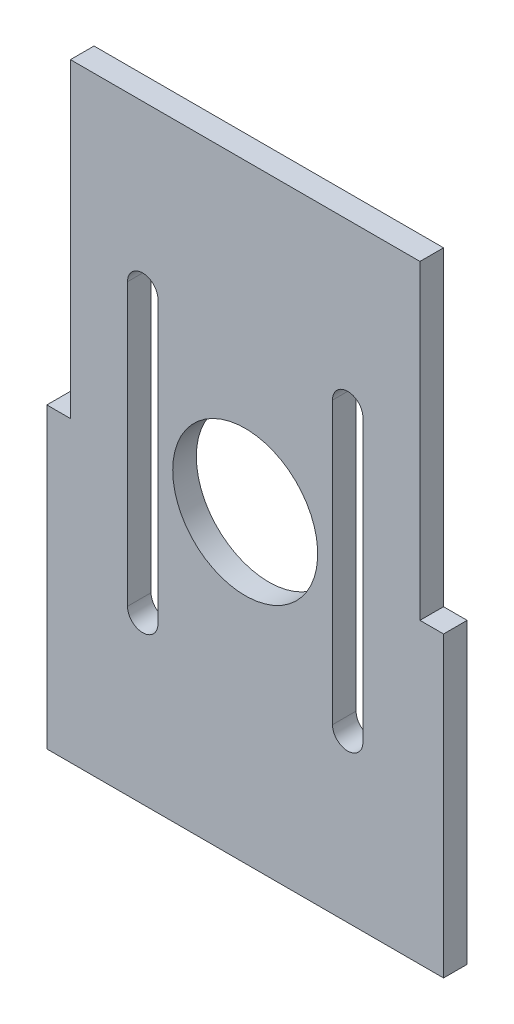
ISO-10303-21;
HEADER;
FILE_DESCRIPTION(('STEP AP214'),'2;1');
FILE_NAME('part.step','',(''),(''),'','','');
FILE_SCHEMA(('AUTOMOTIVE_DESIGN { 1 0 10303 214 1 1 1 1 }'));
ENDSEC;
DATA;
#1=APPLICATION_CONTEXT('core data for automotive mechanical design processes');
#2=APPLICATION_PROTOCOL_DEFINITION('international standard','automotive_design',2000,#1);
#3=PRODUCT_CONTEXT('',#1,'mechanical');
#4=PRODUCT('Part','Part','',(#3));
#5=PRODUCT_RELATED_PRODUCT_CATEGORY('part','',(#4));
#6=PRODUCT_DEFINITION_FORMATION('','',#4);
#7=PRODUCT_DEFINITION_CONTEXT('part definition',#1,'design');
#8=PRODUCT_DEFINITION('design','',#6,#7);
#9=PRODUCT_DEFINITION_SHAPE('','',#8);
#10=(LENGTH_UNIT() NAMED_UNIT(*) SI_UNIT(.MILLI.,.METRE.));
#11=(NAMED_UNIT(*) PLANE_ANGLE_UNIT() SI_UNIT($,.RADIAN.));
#12=(NAMED_UNIT(*) SI_UNIT($,.STERADIAN.) SOLID_ANGLE_UNIT());
#13=UNCERTAINTY_MEASURE_WITH_UNIT(LENGTH_MEASURE(1.E-05),#10,'distance_accuracy_value','');
#14=(GEOMETRIC_REPRESENTATION_CONTEXT(3) GLOBAL_UNCERTAINTY_ASSIGNED_CONTEXT((#13)) GLOBAL_UNIT_ASSIGNED_CONTEXT((#10,
#11,#12)) REPRESENTATION_CONTEXT('',''));
#15=CARTESIAN_POINT('',(0.,0.,0.));
#16=DIRECTION('',(0.,0.,1.));
#17=DIRECTION('',(1.,0.,0.));
#18=AXIS2_PLACEMENT_3D('',#15,#16,#17);
#19=CARTESIAN_POINT('',(0.,0.,3.1));
#20=DIRECTION('',(0.,0.,-1.));
#21=DIRECTION('',(-1.,0.,0.));
#22=AXIS2_PLACEMENT_3D('',#19,#20,#21);
#23=PLANE('',#22);
#24=CARTESIAN_POINT('',(-13.4703841816037,18.4703841816037,3.1));
#25=DIRECTION('',(0.,0.,-1.));
#26=DIRECTION('',(-1.,0.,0.));
#27=AXIS2_PLACEMENT_3D('',#24,#25,#26);
#28=CIRCLE('',#27,1.99999999999998);
#29=CARTESIAN_POINT('',(-11.4703841816037,18.4703841816037,3.1));
#30=VERTEX_POINT('',#29);
#31=CARTESIAN_POINT('',(-15.4703841816037,18.4703841816037,3.1));
#32=VERTEX_POINT('',#31);
#33=EDGE_CURVE('E211',#30,#32,#28,.F.);
#34=ORIENTED_EDGE('',*,*,#33,.F.);
#35=DIRECTION('',(0.,1.,0.));
#36=VECTOR('',#35,1.);
#37=CARTESIAN_POINT('',(-11.4703841816037,0.,3.1));
#38=LINE('',#37,#36);
#39=CARTESIAN_POINT('',(-11.4703841816038,-18.4703841816038,3.1));
#40=VERTEX_POINT('',#39);
#41=EDGE_CURVE('E204',#40,#30,#38,.T.);
#42=ORIENTED_EDGE('',*,*,#41,.F.);
#43=CARTESIAN_POINT('',(-13.4703841816037,-18.4703841816038,3.1));
#44=DIRECTION('',(0.,0.,-1.));
#45=DIRECTION('',(-1.,0.,0.));
#46=AXIS2_PLACEMENT_3D('',#43,#44,#45);
#47=CIRCLE('',#46,1.99999999999998);
#48=CARTESIAN_POINT('',(-15.4703841816037,-18.4703841816038,3.1));
#49=VERTEX_POINT('',#48);
#50=EDGE_CURVE('E206',#49,#40,#47,.F.);
#51=ORIENTED_EDGE('',*,*,#50,.F.);
#52=DIRECTION('',(0.,-1.,0.));
#53=VECTOR('',#52,1.);
#54=CARTESIAN_POINT('',(-15.4703841816037,0.,3.1));
#55=LINE('',#54,#53);
#56=EDGE_CURVE('E209',#32,#49,#55,.T.);
#57=ORIENTED_EDGE('',*,*,#56,.F.);
#58=EDGE_LOOP('',(#34,#42,#51,#57));
#59=FACE_BOUND('',#58,.T.);
#60=DIRECTION('',(1.,0.,0.));
#61=VECTOR('',#60,1.);
#62=CARTESIAN_POINT('',(-22.965,-40.,3.1));
#63=LINE('',#62,#61);
#64=CARTESIAN_POINT('',(-26.065,-40.,3.1));
#65=VERTEX_POINT('',#64);
#66=CARTESIAN_POINT('',(26.065,-40.,3.1));
#67=VERTEX_POINT('',#66);
#68=EDGE_CURVE('E295',#65,#67,#63,.T.);
#69=ORIENTED_EDGE('',*,*,#68,.T.);
#70=DIRECTION('',(0.,1.,0.));
#71=VECTOR('',#70,1.);
#72=CARTESIAN_POINT('',(26.065,-0.846178762556278,3.1));
#73=LINE('',#72,#71);
#74=CARTESIAN_POINT('',(26.065,-0.846178762556278,3.1));
#75=VERTEX_POINT('',#74);
#76=EDGE_CURVE('E261',#67,#75,#73,.T.);
#77=ORIENTED_EDGE('',*,*,#76,.T.);
#78=DIRECTION('',(-1.,0.,0.));
#79=VECTOR('',#78,1.);
#80=CARTESIAN_POINT('',(22.965,-0.846178762556279,3.1));
#81=LINE('',#80,#79);
#82=CARTESIAN_POINT('',(22.965,-0.846178762556279,3.1));
#83=VERTEX_POINT('',#82);
#84=EDGE_CURVE('E264',#75,#83,#81,.T.);
#85=ORIENTED_EDGE('',*,*,#84,.T.);
#86=DIRECTION('',(0.,1.,0.));
#87=VECTOR('',#86,1.);
#88=CARTESIAN_POINT('',(22.965,-40.,3.1));
#89=LINE('',#88,#87);
#90=CARTESIAN_POINT('',(22.965,40.,3.1));
#91=VERTEX_POINT('',#90);
#92=EDGE_CURVE('E293',#83,#91,#89,.T.);
#93=ORIENTED_EDGE('',*,*,#92,.T.);
#94=DIRECTION('',(-1.,0.,0.));
#95=VECTOR('',#94,1.);
#96=CARTESIAN_POINT('',(-22.965,40.,3.1));
#97=LINE('',#96,#95);
#98=CARTESIAN_POINT('',(-22.965,40.,3.1));
#99=VERTEX_POINT('',#98);
#100=EDGE_CURVE('E301',#91,#99,#97,.T.);
#101=ORIENTED_EDGE('',*,*,#100,.T.);
#102=DIRECTION('',(0.,-1.,0.));
#103=VECTOR('',#102,1.);
#104=CARTESIAN_POINT('',(-22.965,-40.,3.1));
#105=LINE('',#104,#103);
#106=CARTESIAN_POINT('',(-22.965,-0.846178762556285,3.1));
#107=VERTEX_POINT('',#106);
#108=EDGE_CURVE('E236',#99,#107,#105,.T.);
#109=ORIENTED_EDGE('',*,*,#108,.T.);
#110=DIRECTION('',(-1.,0.,0.));
#111=VECTOR('',#110,1.);
#112=CARTESIAN_POINT('',(-22.965,-0.846178762556284,3.1));
#113=LINE('',#112,#111);
#114=CARTESIAN_POINT('',(-26.065,-0.846178762556284,3.1));
#115=VERTEX_POINT('',#114);
#116=EDGE_CURVE('E224',#107,#115,#113,.T.);
#117=ORIENTED_EDGE('',*,*,#116,.T.);
#118=DIRECTION('',(0.,-1.,0.));
#119=VECTOR('',#118,1.);
#120=CARTESIAN_POINT('',(-26.065,-0.846178762556284,3.1));
#121=LINE('',#120,#119);
#122=EDGE_CURVE('E220',#115,#65,#121,.T.);
#123=ORIENTED_EDGE('',*,*,#122,.T.);
#124=EDGE_LOOP('',(#69,#77,#85,#93,#101,#109,#117,#123));
#125=FACE_BOUND('',#124,.T.);
#126=CARTESIAN_POINT('',(0.,0.,3.1));
#127=DIRECTION('',(0.,0.,-1.));
#128=DIRECTION('',(-1.,0.,0.));
#129=AXIS2_PLACEMENT_3D('',#126,#127,#128);
#130=CIRCLE('',#129,9.525);
#131=CARTESIAN_POINT('',(-9.525,0.,3.1));
#132=VERTEX_POINT('',#131);
#133=EDGE_CURVE('E216',#132,#132,#130,.F.);
#134=ORIENTED_EDGE('',*,*,#133,.F.);
#135=EDGE_LOOP('',(#134));
#136=FACE_BOUND('',#135,.T.);
#137=CARTESIAN_POINT('',(13.4703841816037,-18.4703841816038,3.1));
#138=DIRECTION('',(0.,0.,-1.));
#139=DIRECTION('',(-1.,0.,0.));
#140=AXIS2_PLACEMENT_3D('',#137,#138,#139);
#141=CIRCLE('',#140,1.99999999999998);
#142=CARTESIAN_POINT('',(11.4703841816037,-18.4703841816038,3.1));
#143=VERTEX_POINT('',#142);
#144=CARTESIAN_POINT('',(15.4703841816037,-18.4703841816038,3.1));
#145=VERTEX_POINT('',#144);
#146=EDGE_CURVE('E151',#143,#145,#141,.F.);
#147=ORIENTED_EDGE('',*,*,#146,.F.);
#148=DIRECTION('',(0.,-1.,0.));
#149=VECTOR('',#148,1.);
#150=CARTESIAN_POINT('',(11.4703841816037,0.,3.1));
#151=LINE('',#150,#149);
#152=CARTESIAN_POINT('',(11.4703841816037,18.4703841816037,3.1));
#153=VERTEX_POINT('',#152);
#154=EDGE_CURVE('E176',#153,#143,#151,.T.);
#155=ORIENTED_EDGE('',*,*,#154,.F.);
#156=CARTESIAN_POINT('',(13.4703841816037,18.4703841816037,3.1));
#157=DIRECTION('',(0.,0.,-1.));
#158=DIRECTION('',(-1.,0.,0.));
#159=AXIS2_PLACEMENT_3D('',#156,#157,#158);
#160=CIRCLE('',#159,1.99999999999998);
#161=CARTESIAN_POINT('',(15.4703841816037,18.4703841816037,3.1));
#162=VERTEX_POINT('',#161);
#163=EDGE_CURVE('E178',#162,#153,#160,.F.);
#164=ORIENTED_EDGE('',*,*,#163,.F.);
#165=DIRECTION('',(0.,1.,0.));
#166=VECTOR('',#165,1.);
#167=CARTESIAN_POINT('',(15.4703841816037,0.,3.1));
#168=LINE('',#167,#166);
#169=EDGE_CURVE('E180',#145,#162,#168,.T.);
#170=ORIENTED_EDGE('',*,*,#169,.F.);
#171=EDGE_LOOP('',(#147,#155,#164,#170));
#172=FACE_BOUND('',#171,.T.);
#173=ADVANCED_FACE('F33',(#59,#125,#136,#172),#23,.F.);
#174=CARTESIAN_POINT('',(0.,0.,0.));
#175=DIRECTION('',(0.,0.,-1.));
#176=DIRECTION('',(-1.,0.,0.));
#177=AXIS2_PLACEMENT_3D('',#174,#175,#176);
#178=PLANE('',#177);
#179=DIRECTION('',(0.,1.,0.));
#180=VECTOR('',#179,1.);
#181=CARTESIAN_POINT('',(-11.4703841816037,-13.4703841816038,0.));
#182=LINE('',#181,#180);
#183=CARTESIAN_POINT('',(-11.4703841816038,-18.4703841816038,0.));
#184=VERTEX_POINT('',#183);
#185=CARTESIAN_POINT('',(-11.4703841816037,18.4703841816037,0.));
#186=VERTEX_POINT('',#185);
#187=EDGE_CURVE('E192',#184,#186,#182,.T.);
#188=ORIENTED_EDGE('',*,*,#187,.T.);
#189=CARTESIAN_POINT('',(-13.4703841816037,18.4703841816037,0.));
#190=DIRECTION('',(0.,0.,1.));
#191=DIRECTION('',(1.,0.,0.));
#192=AXIS2_PLACEMENT_3D('',#189,#190,#191);
#193=CIRCLE('',#192,1.99999999999998);
#194=CARTESIAN_POINT('',(-15.4703841816037,18.4703841816037,0.));
#195=VERTEX_POINT('',#194);
#196=EDGE_CURVE('E183',#186,#195,#193,.T.);
#197=ORIENTED_EDGE('',*,*,#196,.T.);
#198=DIRECTION('',(0.,-1.,0.));
#199=VECTOR('',#198,1.);
#200=CARTESIAN_POINT('',(-15.4703841816037,-13.4703841816038,0.));
#201=LINE('',#200,#199);
#202=CARTESIAN_POINT('',(-15.4703841816037,-18.4703841816038,0.));
#203=VERTEX_POINT('',#202);
#204=EDGE_CURVE('E186',#195,#203,#201,.T.);
#205=ORIENTED_EDGE('',*,*,#204,.T.);
#206=CARTESIAN_POINT('',(-13.4703841816037,-18.4703841816038,0.));
#207=DIRECTION('',(0.,0.,1.));
#208=DIRECTION('',(1.,0.,0.));
#209=AXIS2_PLACEMENT_3D('',#206,#207,#208);
#210=CIRCLE('',#209,1.99999999999998);
#211=EDGE_CURVE('E189',#203,#184,#210,.T.);
#212=ORIENTED_EDGE('',*,*,#211,.T.);
#213=EDGE_LOOP('',(#188,#197,#205,#212));
#214=FACE_BOUND('',#213,.T.);
#215=DIRECTION('',(0.,1.,0.));
#216=VECTOR('',#215,1.);
#217=CARTESIAN_POINT('',(22.965,-40.,0.));
#218=LINE('',#217,#216);
#219=CARTESIAN_POINT('',(22.965,-0.846178762556278,0.));
#220=VERTEX_POINT('',#219);
#221=CARTESIAN_POINT('',(22.965,40.,0.));
#222=VERTEX_POINT('',#221);
#223=EDGE_CURVE('E280',#220,#222,#218,.T.);
#224=ORIENTED_EDGE('',*,*,#223,.F.);
#225=DIRECTION('',(-1.,0.,0.));
#226=VECTOR('',#225,1.);
#227=CARTESIAN_POINT('',(22.965,-0.846178762556279,0.));
#228=LINE('',#227,#226);
#229=CARTESIAN_POINT('',(26.065,-0.846178762556278,0.));
#230=VERTEX_POINT('',#229);
#231=EDGE_CURVE('E256',#230,#220,#228,.T.);
#232=ORIENTED_EDGE('',*,*,#231,.F.);
#233=DIRECTION('',(0.,1.,0.));
#234=VECTOR('',#233,1.);
#235=CARTESIAN_POINT('',(26.065,-0.846178762556278,0.));
#236=LINE('',#235,#234);
#237=CARTESIAN_POINT('',(26.065,-40.,0.));
#238=VERTEX_POINT('',#237);
#239=EDGE_CURVE('E257',#238,#230,#236,.T.);
#240=ORIENTED_EDGE('',*,*,#239,.F.);
#241=DIRECTION('',(1.,0.,0.));
#242=VECTOR('',#241,1.);
#243=CARTESIAN_POINT('',(-22.965,-40.,0.));
#244=LINE('',#243,#242);
#245=CARTESIAN_POINT('',(-26.065,-40.,0.));
#246=VERTEX_POINT('',#245);
#247=EDGE_CURVE('E286',#246,#238,#244,.T.);
#248=ORIENTED_EDGE('',*,*,#247,.F.);
#249=DIRECTION('',(0.,-1.,0.));
#250=VECTOR('',#249,1.);
#251=CARTESIAN_POINT('',(-26.065,-0.846178762556284,0.));
#252=LINE('',#251,#250);
#253=CARTESIAN_POINT('',(-26.065,-0.846178762556284,0.));
#254=VERTEX_POINT('',#253);
#255=EDGE_CURVE('E225',#254,#246,#252,.T.);
#256=ORIENTED_EDGE('',*,*,#255,.F.);
#257=DIRECTION('',(-1.,0.,0.));
#258=VECTOR('',#257,1.);
#259=CARTESIAN_POINT('',(-22.965,-0.846178762556284,0.));
#260=LINE('',#259,#258);
#261=CARTESIAN_POINT('',(-22.965,-0.846178762556284,0.));
#262=VERTEX_POINT('',#261);
#263=EDGE_CURVE('E219',#262,#254,#260,.T.);
#264=ORIENTED_EDGE('',*,*,#263,.F.);
#265=DIRECTION('',(0.,-1.,0.));
#266=VECTOR('',#265,1.);
#267=CARTESIAN_POINT('',(-22.965,-40.,0.));
#268=LINE('',#267,#266);
#269=CARTESIAN_POINT('',(-22.965,40.,0.));
#270=VERTEX_POINT('',#269);
#271=EDGE_CURVE('E284',#270,#262,#268,.T.);
#272=ORIENTED_EDGE('',*,*,#271,.F.);
#273=DIRECTION('',(-1.,0.,0.));
#274=VECTOR('',#273,1.);
#275=CARTESIAN_POINT('',(-22.965,40.,0.));
#276=LINE('',#275,#274);
#277=EDGE_CURVE('E287',#222,#270,#276,.T.);
#278=ORIENTED_EDGE('',*,*,#277,.F.);
#279=EDGE_LOOP('',(#224,#232,#240,#248,#256,#264,#272,#278));
#280=FACE_BOUND('',#279,.T.);
#281=CARTESIAN_POINT('',(0.,0.,0.));
#282=DIRECTION('',(0.,0.,1.));
#283=DIRECTION('',(1.,0.,0.));
#284=AXIS2_PLACEMENT_3D('',#281,#282,#283);
#285=CIRCLE('',#284,9.525);
#286=CARTESIAN_POINT('',(9.525,0.,0.));
#287=VERTEX_POINT('',#286);
#288=EDGE_CURVE('E213',#287,#287,#285,.T.);
#289=ORIENTED_EDGE('',*,*,#288,.T.);
#290=EDGE_LOOP('',(#289));
#291=FACE_BOUND('',#290,.T.);
#292=DIRECTION('',(0.,-1.,0.));
#293=VECTOR('',#292,1.);
#294=CARTESIAN_POINT('',(11.4703841816037,13.4703841816037,0.));
#295=LINE('',#294,#293);
#296=CARTESIAN_POINT('',(11.4703841816037,18.4703841816037,0.));
#297=VERTEX_POINT('',#296);
#298=CARTESIAN_POINT('',(11.4703841816037,-18.4703841816038,0.));
#299=VERTEX_POINT('',#298);
#300=EDGE_CURVE('E168',#297,#299,#295,.T.);
#301=ORIENTED_EDGE('',*,*,#300,.T.);
#302=CARTESIAN_POINT('',(13.4703841816037,-18.4703841816038,0.));
#303=DIRECTION('',(0.,0.,1.));
#304=DIRECTION('',(-1.,0.,0.));
#305=AXIS2_PLACEMENT_3D('',#302,#303,#304);
#306=CIRCLE('',#305,1.99999999999998);
#307=CARTESIAN_POINT('',(15.4703841816037,-18.4703841816038,0.));
#308=VERTEX_POINT('',#307);
#309=EDGE_CURVE('E58',#299,#308,#306,.T.);
#310=ORIENTED_EDGE('',*,*,#309,.T.);
#311=DIRECTION('',(0.,1.,0.));
#312=VECTOR('',#311,1.);
#313=CARTESIAN_POINT('',(15.4703841816037,13.4703841816037,0.));
#314=LINE('',#313,#312);
#315=CARTESIAN_POINT('',(15.4703841816037,18.4703841816037,0.));
#316=VERTEX_POINT('',#315);
#317=EDGE_CURVE('E158',#308,#316,#314,.T.);
#318=ORIENTED_EDGE('',*,*,#317,.T.);
#319=CARTESIAN_POINT('',(13.4703841816037,18.4703841816037,0.));
#320=DIRECTION('',(0.,0.,1.));
#321=DIRECTION('',(-1.,0.,0.));
#322=AXIS2_PLACEMENT_3D('',#319,#320,#321);
#323=CIRCLE('',#322,1.99999999999998);
#324=EDGE_CURVE('E164',#316,#297,#323,.T.);
#325=ORIENTED_EDGE('',*,*,#324,.T.);
#326=EDGE_LOOP('',(#301,#310,#318,#325));
#327=FACE_BOUND('',#326,.T.);
#328=ADVANCED_FACE('F167',(#214,#280,#291,#327),#178,.T.);
#329=CARTESIAN_POINT('',(-22.965,-40.,3.1));
#330=DIRECTION('',(1.,0.,0.));
#331=DIRECTION('',(0.,0.,-1.));
#332=AXIS2_PLACEMENT_3D('',#329,#330,#331);
#333=PLANE('',#332);
#334=DIRECTION('',(0.,0.,-1.));
#335=VECTOR('',#334,1.);
#336=CARTESIAN_POINT('',(-22.965,-0.846178762556284,3.1));
#337=LINE('',#336,#335);
#338=EDGE_CURVE('E223',#107,#262,#337,.T.);
#339=ORIENTED_EDGE('',*,*,#338,.F.);
#340=ORIENTED_EDGE('',*,*,#108,.F.);
#341=DIRECTION('',(0.,0.,-1.));
#342=VECTOR('',#341,1.);
#343=CARTESIAN_POINT('',(-22.965,40.,3.1));
#344=LINE('',#343,#342);
#345=EDGE_CURVE('E42',#99,#270,#344,.T.);
#346=ORIENTED_EDGE('',*,*,#345,.T.);
#347=ORIENTED_EDGE('',*,*,#271,.T.);
#348=EDGE_LOOP('',(#339,#340,#346,#347));
#349=FACE_BOUND('',#348,.T.);
#350=ADVANCED_FACE('F318',(#349),#333,.F.);
#351=CARTESIAN_POINT('',(22.965,-40.,3.1));
#352=DIRECTION('',(-1.,0.,0.));
#353=DIRECTION('',(0.,0.,1.));
#354=AXIS2_PLACEMENT_3D('',#351,#352,#353);
#355=PLANE('',#354);
#356=ORIENTED_EDGE('',*,*,#92,.F.);
#357=DIRECTION('',(0.,0.,-1.));
#358=VECTOR('',#357,1.);
#359=CARTESIAN_POINT('',(22.965,-0.846178762556279,3.1));
#360=LINE('',#359,#358);
#361=EDGE_CURVE('E271',#83,#220,#360,.T.);
#362=ORIENTED_EDGE('',*,*,#361,.T.);
#363=ORIENTED_EDGE('',*,*,#223,.T.);
#364=DIRECTION('',(0.,0.,-1.));
#365=VECTOR('',#364,1.);
#366=CARTESIAN_POINT('',(22.965,40.,3.1));
#367=LINE('',#366,#365);
#368=EDGE_CURVE('E11',#91,#222,#367,.T.);
#369=ORIENTED_EDGE('',*,*,#368,.F.);
#370=EDGE_LOOP('',(#356,#362,#363,#369));
#371=FACE_BOUND('',#370,.T.);
#372=ADVANCED_FACE('F35',(#371),#355,.F.);
#373=CARTESIAN_POINT('',(-22.965,40.,3.1));
#374=DIRECTION('',(0.,-1.,0.));
#375=DIRECTION('',(0.,0.,-1.));
#376=AXIS2_PLACEMENT_3D('',#373,#374,#375);
#377=PLANE('',#376);
#378=ORIENTED_EDGE('',*,*,#277,.T.);
#379=ORIENTED_EDGE('',*,*,#345,.F.);
#380=ORIENTED_EDGE('',*,*,#100,.F.);
#381=ORIENTED_EDGE('',*,*,#368,.T.);
#382=EDGE_LOOP('',(#378,#379,#380,#381));
#383=FACE_BOUND('',#382,.T.);
#384=ADVANCED_FACE('F310',(#383),#377,.F.);
#385=CARTESIAN_POINT('',(-22.965,-40.,3.1));
#386=DIRECTION('',(0.,1.,0.));
#387=DIRECTION('',(0.,0.,1.));
#388=AXIS2_PLACEMENT_3D('',#385,#386,#387);
#389=PLANE('',#388);
#390=ORIENTED_EDGE('',*,*,#247,.T.);
#391=DIRECTION('',(0.,0.,-1.));
#392=VECTOR('',#391,1.);
#393=CARTESIAN_POINT('',(26.065,-40.,3.1));
#394=LINE('',#393,#392);
#395=EDGE_CURVE('E268',#67,#238,#394,.T.);
#396=ORIENTED_EDGE('',*,*,#395,.F.);
#397=ORIENTED_EDGE('',*,*,#68,.F.);
#398=DIRECTION('',(0.,0.,-1.));
#399=VECTOR('',#398,1.);
#400=CARTESIAN_POINT('',(-26.065,-40.,3.1));
#401=LINE('',#400,#399);
#402=EDGE_CURVE('E230',#65,#246,#401,.T.);
#403=ORIENTED_EDGE('',*,*,#402,.T.);
#404=EDGE_LOOP('',(#390,#396,#397,#403));
#405=FACE_BOUND('',#404,.T.);
#406=ADVANCED_FACE('F322',(#405),#389,.F.);
#407=CARTESIAN_POINT('',(22.965,-0.846178762556279,3.1));
#408=DIRECTION('',(0.,-1.,0.));
#409=DIRECTION('',(1.,0.,0.));
#410=AXIS2_PLACEMENT_3D('',#407,#408,#409);
#411=PLANE('',#410);
#412=ORIENTED_EDGE('',*,*,#231,.T.);
#413=ORIENTED_EDGE('',*,*,#361,.F.);
#414=ORIENTED_EDGE('',*,*,#84,.F.);
#415=DIRECTION('',(0.,0.,-1.));
#416=VECTOR('',#415,1.);
#417=CARTESIAN_POINT('',(26.065,-0.846178762556278,3.1));
#418=LINE('',#417,#416);
#419=EDGE_CURVE('E263',#75,#230,#418,.T.);
#420=ORIENTED_EDGE('',*,*,#419,.T.);
#421=EDGE_LOOP('',(#412,#413,#414,#420));
#422=FACE_BOUND('',#421,.T.);
#423=ADVANCED_FACE('F329',(#422),#411,.F.);
#424=CARTESIAN_POINT('',(26.065,-0.846178762556278,3.1));
#425=DIRECTION('',(-1.,0.,0.));
#426=DIRECTION('',(0.,-1.,0.));
#427=AXIS2_PLACEMENT_3D('',#424,#425,#426);
#428=PLANE('',#427);
#429=ORIENTED_EDGE('',*,*,#239,.T.);
#430=ORIENTED_EDGE('',*,*,#419,.F.);
#431=ORIENTED_EDGE('',*,*,#76,.F.);
#432=ORIENTED_EDGE('',*,*,#395,.T.);
#433=EDGE_LOOP('',(#429,#430,#431,#432));
#434=FACE_BOUND('',#433,.T.);
#435=ADVANCED_FACE('F327',(#434),#428,.F.);
#436=CARTESIAN_POINT('',(-22.965,-0.846178762556284,3.1));
#437=DIRECTION('',(0.,-1.,0.));
#438=DIRECTION('',(1.,0.,0.));
#439=AXIS2_PLACEMENT_3D('',#436,#437,#438);
#440=PLANE('',#439);
#441=ORIENTED_EDGE('',*,*,#263,.T.);
#442=DIRECTION('',(0.,0.,-1.));
#443=VECTOR('',#442,1.);
#444=CARTESIAN_POINT('',(-26.065,-0.846178762556284,3.1));
#445=LINE('',#444,#443);
#446=EDGE_CURVE('E252',#115,#254,#445,.T.);
#447=ORIENTED_EDGE('',*,*,#446,.F.);
#448=ORIENTED_EDGE('',*,*,#116,.F.);
#449=ORIENTED_EDGE('',*,*,#338,.T.);
#450=EDGE_LOOP('',(#441,#447,#448,#449));
#451=FACE_BOUND('',#450,.T.);
#452=ADVANCED_FACE('F253',(#451),#440,.F.);
#453=CARTESIAN_POINT('',(-26.065,-0.846178762556284,3.1));
#454=DIRECTION('',(1.,0.,0.));
#455=DIRECTION('',(0.,1.,0.));
#456=AXIS2_PLACEMENT_3D('',#453,#454,#455);
#457=PLANE('',#456);
#458=ORIENTED_EDGE('',*,*,#255,.T.);
#459=ORIENTED_EDGE('',*,*,#402,.F.);
#460=ORIENTED_EDGE('',*,*,#122,.F.);
#461=ORIENTED_EDGE('',*,*,#446,.T.);
#462=EDGE_LOOP('',(#458,#459,#460,#461));
#463=FACE_BOUND('',#462,.T.);
#464=ADVANCED_FACE('F320',(#463),#457,.F.);
#465=CARTESIAN_POINT('',(0.,0.,3.10005));
#466=DIRECTION('',(0.,0.,-1.));
#467=DIRECTION('',(-1.,0.,0.));
#468=AXIS2_PLACEMENT_3D('',#465,#466,#467);
#469=CYLINDRICAL_SURFACE('',#468,9.525);
#470=ORIENTED_EDGE('',*,*,#288,.F.);
#471=EDGE_LOOP('',(#470));
#472=FACE_BOUND('',#471,.T.);
#473=ORIENTED_EDGE('',*,*,#133,.T.);
#474=EDGE_LOOP('',(#473));
#475=FACE_BOUND('',#474,.T.);
#476=ADVANCED_FACE('F374',(#472,#475),#469,.F.);
#477=CARTESIAN_POINT('',(-13.4703841816037,18.4703841816037,3.10005));
#478=DIRECTION('',(0.,0.,-1.));
#479=DIRECTION('',(-1.,0.,0.));
#480=AXIS2_PLACEMENT_3D('',#477,#478,#479);
#481=CYLINDRICAL_SURFACE('',#480,1.99999999999998);
#482=ORIENTED_EDGE('',*,*,#33,.T.);
#483=DIRECTION('',(0.,0.,-1.));
#484=VECTOR('',#483,1.);
#485=CARTESIAN_POINT('',(-15.4703841816037,18.4703841816037,3.10005));
#486=LINE('',#485,#484);
#487=EDGE_CURVE('E199',#32,#195,#486,.T.);
#488=ORIENTED_EDGE('',*,*,#487,.T.);
#489=ORIENTED_EDGE('',*,*,#196,.F.);
#490=DIRECTION('',(0.,0.,-1.));
#491=VECTOR('',#490,1.);
#492=CARTESIAN_POINT('',(-11.4703841816037,18.4703841816037,3.10005));
#493=LINE('',#492,#491);
#494=EDGE_CURVE('E201',#30,#186,#493,.T.);
#495=ORIENTED_EDGE('',*,*,#494,.F.);
#496=EDGE_LOOP('',(#482,#488,#489,#495));
#497=FACE_BOUND('',#496,.T.);
#498=ADVANCED_FACE('F379',(#497),#481,.F.);
#499=CARTESIAN_POINT('',(-15.4703841816037,-13.4703841816038,3.10005));
#500=DIRECTION('',(1.,0.,0.));
#501=DIRECTION('',(0.,0.,-1.));
#502=AXIS2_PLACEMENT_3D('',#499,#500,#501);
#503=PLANE('',#502);
#504=ORIENTED_EDGE('',*,*,#56,.T.);
#505=DIRECTION('',(0.,0.,-1.));
#506=VECTOR('',#505,1.);
#507=CARTESIAN_POINT('',(-15.4703841816037,-18.4703841816038,3.10005));
#508=LINE('',#507,#506);
#509=EDGE_CURVE('E197',#49,#203,#508,.T.);
#510=ORIENTED_EDGE('',*,*,#509,.T.);
#511=ORIENTED_EDGE('',*,*,#204,.F.);
#512=ORIENTED_EDGE('',*,*,#487,.F.);
#513=EDGE_LOOP('',(#504,#510,#511,#512));
#514=FACE_BOUND('',#513,.T.);
#515=ADVANCED_FACE('F390',(#514),#503,.T.);
#516=CARTESIAN_POINT('',(-13.4703841816037,-18.4703841816038,3.10005));
#517=DIRECTION('',(0.,0.,-1.));
#518=DIRECTION('',(-1.,0.,0.));
#519=AXIS2_PLACEMENT_3D('',#516,#517,#518);
#520=CYLINDRICAL_SURFACE('',#519,1.99999999999998);
#521=ORIENTED_EDGE('',*,*,#50,.T.);
#522=DIRECTION('',(0.,0.,-1.));
#523=VECTOR('',#522,1.);
#524=CARTESIAN_POINT('',(-11.4703841816038,-18.4703841816038,3.10005));
#525=LINE('',#524,#523);
#526=EDGE_CURVE('E195',#40,#184,#525,.T.);
#527=ORIENTED_EDGE('',*,*,#526,.T.);
#528=ORIENTED_EDGE('',*,*,#211,.F.);
#529=ORIENTED_EDGE('',*,*,#509,.F.);
#530=EDGE_LOOP('',(#521,#527,#528,#529));
#531=FACE_BOUND('',#530,.T.);
#532=ADVANCED_FACE('F401',(#531),#520,.F.);
#533=CARTESIAN_POINT('',(-11.4703841816037,-13.4703841816038,3.10005));
#534=DIRECTION('',(-1.,0.,0.));
#535=DIRECTION('',(0.,-1.,0.));
#536=AXIS2_PLACEMENT_3D('',#533,#534,#535);
#537=PLANE('',#536);
#538=ORIENTED_EDGE('',*,*,#41,.T.);
#539=ORIENTED_EDGE('',*,*,#494,.T.);
#540=ORIENTED_EDGE('',*,*,#187,.F.);
#541=ORIENTED_EDGE('',*,*,#526,.F.);
#542=EDGE_LOOP('',(#538,#539,#540,#541));
#543=FACE_BOUND('',#542,.T.);
#544=ADVANCED_FACE('F412',(#543),#537,.T.);
#545=CARTESIAN_POINT('',(13.4703841816037,-18.4703841816038,3.10005));
#546=DIRECTION('',(0.,0.,-1.));
#547=DIRECTION('',(-1.,0.,0.));
#548=AXIS2_PLACEMENT_3D('',#545,#546,#547);
#549=CYLINDRICAL_SURFACE('',#548,1.99999999999998);
#550=ORIENTED_EDGE('',*,*,#146,.T.);
#551=DIRECTION('',(0.,0.,-1.));
#552=VECTOR('',#551,1.);
#553=CARTESIAN_POINT('',(15.4703841816037,-18.4703841816038,3.10005));
#554=LINE('',#553,#552);
#555=EDGE_CURVE('E147',#145,#308,#554,.T.);
#556=ORIENTED_EDGE('',*,*,#555,.T.);
#557=ORIENTED_EDGE('',*,*,#309,.F.);
#558=DIRECTION('',(0.,0.,-1.));
#559=VECTOR('',#558,1.);
#560=CARTESIAN_POINT('',(11.4703841816037,-18.4703841816038,3.10005));
#561=LINE('',#560,#559);
#562=EDGE_CURVE('E154',#143,#299,#561,.T.);
#563=ORIENTED_EDGE('',*,*,#562,.F.);
#564=EDGE_LOOP('',(#550,#556,#557,#563));
#565=FACE_BOUND('',#564,.T.);
#566=ADVANCED_FACE('F149',(#565),#549,.F.);
#567=CARTESIAN_POINT('',(15.4703841816037,13.4703841816037,3.10005));
#568=DIRECTION('',(-1.,0.,0.));
#569=DIRECTION('',(0.,0.,1.));
#570=AXIS2_PLACEMENT_3D('',#567,#568,#569);
#571=PLANE('',#570);
#572=ORIENTED_EDGE('',*,*,#169,.T.);
#573=DIRECTION('',(0.,0.,-1.));
#574=VECTOR('',#573,1.);
#575=CARTESIAN_POINT('',(15.4703841816037,18.4703841816037,3.10005));
#576=LINE('',#575,#574);
#577=EDGE_CURVE('E155',#162,#316,#576,.T.);
#578=ORIENTED_EDGE('',*,*,#577,.T.);
#579=ORIENTED_EDGE('',*,*,#317,.F.);
#580=ORIENTED_EDGE('',*,*,#555,.F.);
#581=EDGE_LOOP('',(#572,#578,#579,#580));
#582=FACE_BOUND('',#581,.T.);
#583=ADVANCED_FACE('F159',(#582),#571,.T.);
#584=CARTESIAN_POINT('',(13.4703841816037,18.4703841816037,3.10005));
#585=DIRECTION('',(0.,0.,-1.));
#586=DIRECTION('',(-1.,0.,0.));
#587=AXIS2_PLACEMENT_3D('',#584,#585,#586);
#588=CYLINDRICAL_SURFACE('',#587,1.99999999999998);
#589=ORIENTED_EDGE('',*,*,#163,.T.);
#590=DIRECTION('',(0.,0.,-1.));
#591=VECTOR('',#590,1.);
#592=CARTESIAN_POINT('',(11.4703841816037,18.4703841816037,3.10005));
#593=LINE('',#592,#591);
#594=EDGE_CURVE('E50',#153,#297,#593,.T.);
#595=ORIENTED_EDGE('',*,*,#594,.T.);
#596=ORIENTED_EDGE('',*,*,#324,.F.);
#597=ORIENTED_EDGE('',*,*,#577,.F.);
#598=EDGE_LOOP('',(#589,#595,#596,#597));
#599=FACE_BOUND('',#598,.T.);
#600=ADVANCED_FACE('F442',(#599),#588,.F.);
#601=CARTESIAN_POINT('',(11.4703841816037,13.4703841816037,3.10005));
#602=DIRECTION('',(1.,0.,0.));
#603=DIRECTION('',(0.,0.,-1.));
#604=AXIS2_PLACEMENT_3D('',#601,#602,#603);
#605=PLANE('',#604);
#606=ORIENTED_EDGE('',*,*,#154,.T.);
#607=ORIENTED_EDGE('',*,*,#562,.T.);
#608=ORIENTED_EDGE('',*,*,#300,.F.);
#609=ORIENTED_EDGE('',*,*,#594,.F.);
#610=EDGE_LOOP('',(#606,#607,#608,#609));
#611=FACE_BOUND('',#610,.T.);
#612=ADVANCED_FACE('F452',(#611),#605,.T.);
#613=CLOSED_SHELL('',(#173,#328,#350,#372,#384,#406,#423,#435,#452,#464,#476,#498,#515,#532,
#544,#566,#583,#600,#612));
#614=MANIFOLD_SOLID_BREP('B2',#613);
#615=ADVANCED_BREP_SHAPE_REPRESENTATION('',(#18,#614),#14);
#616=SHAPE_DEFINITION_REPRESENTATION(#9,#615);
ENDSEC;
END-ISO-10303-21;
